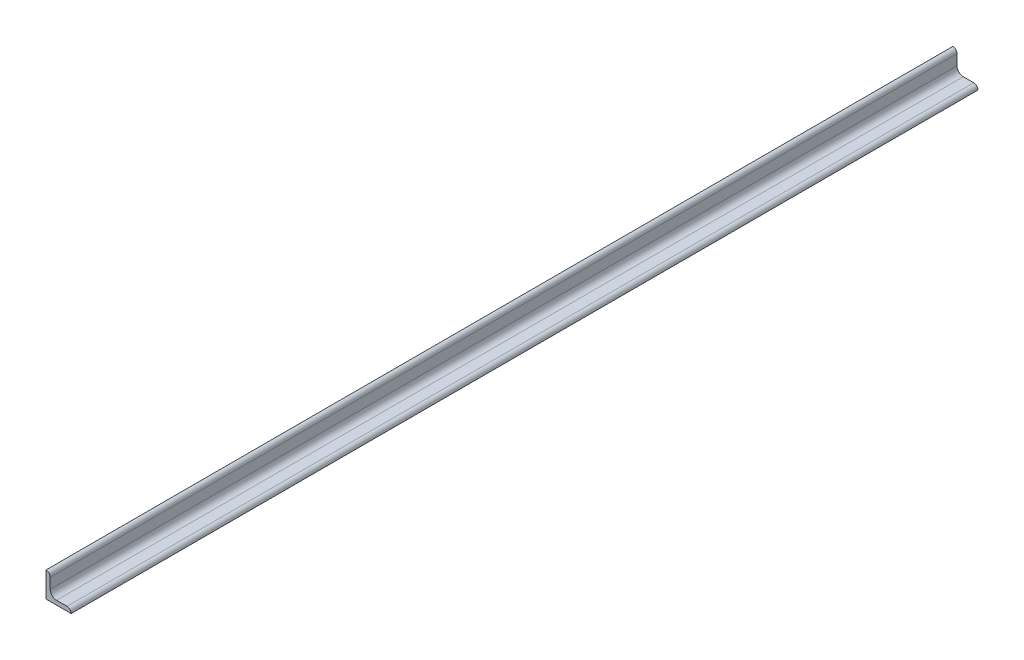
ISO-10303-21;
HEADER;
FILE_DESCRIPTION(('STEP AP214'),'2;1');
FILE_NAME('part.step','',(''),(''),'','','');
FILE_SCHEMA(('AUTOMOTIVE_DESIGN { 1 0 10303 214 1 1 1 1 }'));
ENDSEC;
DATA;
#1=APPLICATION_CONTEXT('core data for automotive mechanical design processes');
#2=APPLICATION_PROTOCOL_DEFINITION('international standard','automotive_design',2000,#1);
#3=PRODUCT_CONTEXT('',#1,'mechanical');
#4=PRODUCT('Part','Part','',(#3));
#5=PRODUCT_RELATED_PRODUCT_CATEGORY('part','',(#4));
#6=PRODUCT_DEFINITION_FORMATION('','',#4);
#7=PRODUCT_DEFINITION_CONTEXT('part definition',#1,'design');
#8=PRODUCT_DEFINITION('design','',#6,#7);
#9=PRODUCT_DEFINITION_SHAPE('','',#8);
#10=(LENGTH_UNIT() NAMED_UNIT(*) SI_UNIT(.MILLI.,.METRE.));
#11=(NAMED_UNIT(*) PLANE_ANGLE_UNIT() SI_UNIT($,.RADIAN.));
#12=(NAMED_UNIT(*) SI_UNIT($,.STERADIAN.) SOLID_ANGLE_UNIT());
#13=UNCERTAINTY_MEASURE_WITH_UNIT(LENGTH_MEASURE(1.E-05),#10,'distance_accuracy_value','');
#14=(GEOMETRIC_REPRESENTATION_CONTEXT(3) GLOBAL_UNCERTAINTY_ASSIGNED_CONTEXT((#13)) GLOBAL_UNIT_ASSIGNED_CONTEXT((#10,
#11,#12)) REPRESENTATION_CONTEXT('',''));
#15=CARTESIAN_POINT('',(0.,0.,0.));
#16=DIRECTION('',(0.,0.,1.));
#17=DIRECTION('',(1.,0.,0.));
#18=AXIS2_PLACEMENT_3D('',#15,#16,#17);
#19=CARTESIAN_POINT('',(19.05,0.,342.9));
#20=DIRECTION('',(0.,1.,0.));
#21=DIRECTION('',(-1.,0.,0.));
#22=AXIS2_PLACEMENT_3D('',#19,#20,#21);
#23=PLANE('',#22);
#24=DIRECTION('',(1.,0.,0.));
#25=VECTOR('',#24,1.);
#26=CARTESIAN_POINT('',(19.05,0.,-342.9));
#27=LINE('',#26,#25);
#28=CARTESIAN_POINT('',(0.,0.,-342.9));
#29=VERTEX_POINT('',#28);
#30=CARTESIAN_POINT('',(19.05,0.,-342.9));
#31=VERTEX_POINT('',#30);
#32=EDGE_CURVE('E134',#29,#31,#27,.T.);
#33=ORIENTED_EDGE('',*,*,#32,.T.);
#34=DIRECTION('',(0.,0.,-1.));
#35=VECTOR('',#34,1.);
#36=CARTESIAN_POINT('',(19.05,0.,342.9));
#37=LINE('',#36,#35);
#38=CARTESIAN_POINT('',(19.05,0.,342.9));
#39=VERTEX_POINT('',#38);
#40=EDGE_CURVE('E11',#39,#31,#37,.T.);
#41=ORIENTED_EDGE('',*,*,#40,.F.);
#42=DIRECTION('',(1.,0.,0.));
#43=VECTOR('',#42,1.);
#44=CARTESIAN_POINT('',(19.05,0.,342.9));
#45=LINE('',#44,#43);
#46=CARTESIAN_POINT('',(0.,0.,342.9));
#47=VERTEX_POINT('',#46);
#48=EDGE_CURVE('E150',#47,#39,#45,.T.);
#49=ORIENTED_EDGE('',*,*,#48,.F.);
#50=DIRECTION('',(0.,0.,-1.));
#51=VECTOR('',#50,1.);
#52=CARTESIAN_POINT('',(0.,0.,342.9));
#53=LINE('',#52,#51);
#54=EDGE_CURVE('E130',#47,#29,#53,.T.);
#55=ORIENTED_EDGE('',*,*,#54,.T.);
#56=EDGE_LOOP('',(#33,#41,#49,#55));
#57=FACE_BOUND('',#56,.T.);
#58=ADVANCED_FACE('F32',(#57),#23,.F.);
#59=CARTESIAN_POINT('',(19.05,0.00507999999999611,342.9));
#60=DIRECTION('',(-1.,0.,0.));
#61=DIRECTION('',(0.,0.,1.));
#62=AXIS2_PLACEMENT_3D('',#59,#60,#61);
#63=PLANE('',#62);
#64=DIRECTION('',(0.,1.,0.));
#65=VECTOR('',#64,1.);
#66=CARTESIAN_POINT('',(19.05,0.00507999999999611,-342.9));
#67=LINE('',#66,#65);
#68=CARTESIAN_POINT('',(19.05,0.00507999999999611,-342.9));
#69=VERTEX_POINT('',#68);
#70=EDGE_CURVE('E137',#31,#69,#67,.T.);
#71=ORIENTED_EDGE('',*,*,#70,.T.);
#72=DIRECTION('',(0.,0.,-1.));
#73=VECTOR('',#72,1.);
#74=CARTESIAN_POINT('',(19.05,0.00507999999999611,342.9));
#75=LINE('',#74,#73);
#76=CARTESIAN_POINT('',(19.05,0.00507999999999611,342.9));
#77=VERTEX_POINT('',#76);
#78=EDGE_CURVE('E40',#77,#69,#75,.T.);
#79=ORIENTED_EDGE('',*,*,#78,.F.);
#80=DIRECTION('',(0.,1.,0.));
#81=VECTOR('',#80,1.);
#82=CARTESIAN_POINT('',(19.05,0.00507999999999611,342.9));
#83=LINE('',#82,#81);
#84=EDGE_CURVE('E94',#39,#77,#83,.T.);
#85=ORIENTED_EDGE('',*,*,#84,.F.);
#86=ORIENTED_EDGE('',*,*,#40,.T.);
#87=EDGE_LOOP('',(#71,#79,#85,#86));
#88=FACE_BOUND('',#87,.T.);
#89=ADVANCED_FACE('F193',(#88),#63,.F.);
#90=CARTESIAN_POINT('',(15.88008,0.00507999999999573,342.9));
#91=DIRECTION('',(0.,0.,-1.));
#92=DIRECTION('',(-1.,0.,0.));
#93=AXIS2_PLACEMENT_3D('',#90,#91,#92);
#94=CYLINDRICAL_SURFACE('',#93,3.16992);
#95=CARTESIAN_POINT('',(15.88008,0.00507999999999573,-342.9));
#96=DIRECTION('',(0.,0.,1.));
#97=DIRECTION('',(1.,0.,0.));
#98=AXIS2_PLACEMENT_3D('',#95,#96,#97);
#99=CIRCLE('',#98,3.16992);
#100=CARTESIAN_POINT('',(15.88008,3.17499999999999,-342.9));
#101=VERTEX_POINT('',#100);
#102=EDGE_CURVE('E139',#69,#101,#99,.T.);
#103=ORIENTED_EDGE('',*,*,#102,.T.);
#104=DIRECTION('',(0.,0.,-1.));
#105=VECTOR('',#104,1.);
#106=CARTESIAN_POINT('',(15.88008,3.17499999999999,342.9));
#107=LINE('',#106,#105);
#108=CARTESIAN_POINT('',(15.88008,3.17499999999999,342.9));
#109=VERTEX_POINT('',#108);
#110=EDGE_CURVE('E160',#109,#101,#107,.T.);
#111=ORIENTED_EDGE('',*,*,#110,.F.);
#112=CARTESIAN_POINT('',(15.88008,0.00507999999999573,342.9));
#113=DIRECTION('',(0.,0.,1.));
#114=DIRECTION('',(1.,0.,0.));
#115=AXIS2_PLACEMENT_3D('',#112,#113,#114);
#116=CIRCLE('',#115,3.16992);
#117=EDGE_CURVE('E168',#77,#109,#116,.T.);
#118=ORIENTED_EDGE('',*,*,#117,.F.);
#119=ORIENTED_EDGE('',*,*,#78,.T.);
#120=EDGE_LOOP('',(#103,#111,#118,#119));
#121=FACE_BOUND('',#120,.T.);
#122=ADVANCED_FACE('F166',(#121),#94,.T.);
#123=CARTESIAN_POINT('',(7.93749999999999,3.175,342.9));
#124=DIRECTION('',(0.,-1.,0.));
#125=DIRECTION('',(1.,0.,0.));
#126=AXIS2_PLACEMENT_3D('',#123,#124,#125);
#127=PLANE('',#126);
#128=DIRECTION('',(-1.,0.,0.));
#129=VECTOR('',#128,1.);
#130=CARTESIAN_POINT('',(7.93749999999999,3.175,-342.9));
#131=LINE('',#130,#129);
#132=CARTESIAN_POINT('',(7.93749999999999,3.17499999999999,-342.9));
#133=VERTEX_POINT('',#132);
#134=EDGE_CURVE('E141',#101,#133,#131,.T.);
#135=ORIENTED_EDGE('',*,*,#134,.T.);
#136=DIRECTION('',(0.,0.,-1.));
#137=VECTOR('',#136,1.);
#138=CARTESIAN_POINT('',(7.93749999999999,3.17499999999999,342.9));
#139=LINE('',#138,#137);
#140=CARTESIAN_POINT('',(7.93749999999999,3.17499999999999,342.9));
#141=VERTEX_POINT('',#140);
#142=EDGE_CURVE('E157',#141,#133,#139,.T.);
#143=ORIENTED_EDGE('',*,*,#142,.F.);
#144=DIRECTION('',(-1.,0.,0.));
#145=VECTOR('',#144,1.);
#146=CARTESIAN_POINT('',(7.93749999999999,3.175,342.9));
#147=LINE('',#146,#145);
#148=EDGE_CURVE('E184',#109,#141,#147,.T.);
#149=ORIENTED_EDGE('',*,*,#148,.F.);
#150=ORIENTED_EDGE('',*,*,#110,.T.);
#151=EDGE_LOOP('',(#135,#143,#149,#150));
#152=FACE_BOUND('',#151,.T.);
#153=ADVANCED_FACE('F177',(#152),#127,.F.);
#154=CARTESIAN_POINT('',(7.93749999999999,7.93749999999999,342.9));
#155=DIRECTION('',(0.,0.,-1.));
#156=DIRECTION('',(-1.,0.,0.));
#157=AXIS2_PLACEMENT_3D('',#154,#155,#156);
#158=CYLINDRICAL_SURFACE('',#157,4.7625);
#159=CARTESIAN_POINT('',(7.93749999999999,7.93749999999999,-342.9));
#160=DIRECTION('',(0.,0.,-1.));
#161=DIRECTION('',(-1.,0.,0.));
#162=AXIS2_PLACEMENT_3D('',#159,#160,#161);
#163=CIRCLE('',#162,4.7625);
#164=CARTESIAN_POINT('',(3.17499999999999,7.93749999999999,-342.9));
#165=VERTEX_POINT('',#164);
#166=EDGE_CURVE('E143',#133,#165,#163,.T.);
#167=ORIENTED_EDGE('',*,*,#166,.T.);
#168=DIRECTION('',(0.,0.,-1.));
#169=VECTOR('',#168,1.);
#170=CARTESIAN_POINT('',(3.17499999999999,7.93749999999999,342.9));
#171=LINE('',#170,#169);
#172=CARTESIAN_POINT('',(3.17499999999999,7.93749999999999,342.9));
#173=VERTEX_POINT('',#172);
#174=EDGE_CURVE('E154',#173,#165,#171,.T.);
#175=ORIENTED_EDGE('',*,*,#174,.F.);
#176=CARTESIAN_POINT('',(7.93749999999999,7.93749999999999,342.9));
#177=DIRECTION('',(0.,0.,-1.));
#178=DIRECTION('',(-1.,0.,0.));
#179=AXIS2_PLACEMENT_3D('',#176,#177,#178);
#180=CIRCLE('',#179,4.7625);
#181=EDGE_CURVE('E183',#141,#173,#180,.T.);
#182=ORIENTED_EDGE('',*,*,#181,.F.);
#183=ORIENTED_EDGE('',*,*,#142,.T.);
#184=EDGE_LOOP('',(#167,#175,#182,#183));
#185=FACE_BOUND('',#184,.T.);
#186=ADVANCED_FACE('F181',(#185),#158,.F.);
#187=CARTESIAN_POINT('',(3.175,15.88008,342.9));
#188=DIRECTION('',(-1.,0.,0.));
#189=DIRECTION('',(0.,-1.,0.));
#190=AXIS2_PLACEMENT_3D('',#187,#188,#189);
#191=PLANE('',#190);
#192=DIRECTION('',(0.,1.,0.));
#193=VECTOR('',#192,1.);
#194=CARTESIAN_POINT('',(3.175,15.88008,-342.9));
#195=LINE('',#194,#193);
#196=CARTESIAN_POINT('',(3.17500000000001,15.88008,-342.9));
#197=VERTEX_POINT('',#196);
#198=EDGE_CURVE('E145',#165,#197,#195,.T.);
#199=ORIENTED_EDGE('',*,*,#198,.T.);
#200=DIRECTION('',(0.,0.,-1.));
#201=VECTOR('',#200,1.);
#202=CARTESIAN_POINT('',(3.17500000000001,15.88008,342.9));
#203=LINE('',#202,#201);
#204=CARTESIAN_POINT('',(3.17500000000001,15.88008,342.9));
#205=VERTEX_POINT('',#204);
#206=EDGE_CURVE('E125',#205,#197,#203,.T.);
#207=ORIENTED_EDGE('',*,*,#206,.F.);
#208=DIRECTION('',(0.,1.,0.));
#209=VECTOR('',#208,1.);
#210=CARTESIAN_POINT('',(3.175,15.88008,342.9));
#211=LINE('',#210,#209);
#212=EDGE_CURVE('E116',#173,#205,#211,.T.);
#213=ORIENTED_EDGE('',*,*,#212,.F.);
#214=ORIENTED_EDGE('',*,*,#174,.T.);
#215=EDGE_LOOP('',(#199,#207,#213,#214));
#216=FACE_BOUND('',#215,.T.);
#217=ADVANCED_FACE('F205',(#216),#191,.F.);
#218=CARTESIAN_POINT('',(0.00508000000000019,15.88008,342.9));
#219=DIRECTION('',(0.,0.,-1.));
#220=DIRECTION('',(-1.,0.,0.));
#221=AXIS2_PLACEMENT_3D('',#218,#219,#220);
#222=CYLINDRICAL_SURFACE('',#221,3.16992);
#223=CARTESIAN_POINT('',(0.00508000000000019,15.88008,-342.9));
#224=DIRECTION('',(0.,0.,1.));
#225=DIRECTION('',(-1.,0.,0.));
#226=AXIS2_PLACEMENT_3D('',#223,#224,#225);
#227=CIRCLE('',#226,3.16992);
#228=CARTESIAN_POINT('',(0.00508,19.05,-342.9));
#229=VERTEX_POINT('',#228);
#230=EDGE_CURVE('E124',#197,#229,#227,.T.);
#231=ORIENTED_EDGE('',*,*,#230,.T.);
#232=DIRECTION('',(0.,0.,-1.));
#233=VECTOR('',#232,1.);
#234=CARTESIAN_POINT('',(0.00508,19.05,342.9));
#235=LINE('',#234,#233);
#236=CARTESIAN_POINT('',(0.00508,19.05,342.9));
#237=VERTEX_POINT('',#236);
#238=EDGE_CURVE('E121',#237,#229,#235,.T.);
#239=ORIENTED_EDGE('',*,*,#238,.F.);
#240=CARTESIAN_POINT('',(0.00508000000000019,15.88008,342.9));
#241=DIRECTION('',(0.,0.,1.));
#242=DIRECTION('',(-1.,0.,0.));
#243=AXIS2_PLACEMENT_3D('',#240,#241,#242);
#244=CIRCLE('',#243,3.16992);
#245=EDGE_CURVE('E110',#205,#237,#244,.T.);
#246=ORIENTED_EDGE('',*,*,#245,.F.);
#247=ORIENTED_EDGE('',*,*,#206,.T.);
#248=EDGE_LOOP('',(#231,#239,#246,#247));
#249=FACE_BOUND('',#248,.T.);
#250=ADVANCED_FACE('F122',(#249),#222,.T.);
#251=CARTESIAN_POINT('',(0.,19.05,342.9));
#252=DIRECTION('',(0.,-1.,0.));
#253=DIRECTION('',(0.,0.,-1.));
#254=AXIS2_PLACEMENT_3D('',#251,#252,#253);
#255=PLANE('',#254);
#256=DIRECTION('',(-1.,0.,0.));
#257=VECTOR('',#256,1.);
#258=CARTESIAN_POINT('',(0.,19.05,-342.9));
#259=LINE('',#258,#257);
#260=CARTESIAN_POINT('',(0.,19.05,-342.9));
#261=VERTEX_POINT('',#260);
#262=EDGE_CURVE('E80',#229,#261,#259,.T.);
#263=ORIENTED_EDGE('',*,*,#262,.T.);
#264=DIRECTION('',(0.,0.,-1.));
#265=VECTOR('',#264,1.);
#266=CARTESIAN_POINT('',(0.,19.05,342.9));
#267=LINE('',#266,#265);
#268=CARTESIAN_POINT('',(0.,19.05,342.9));
#269=VERTEX_POINT('',#268);
#270=EDGE_CURVE('E126',#269,#261,#267,.T.);
#271=ORIENTED_EDGE('',*,*,#270,.F.);
#272=DIRECTION('',(-1.,0.,0.));
#273=VECTOR('',#272,1.);
#274=CARTESIAN_POINT('',(0.,19.05,342.9));
#275=LINE('',#274,#273);
#276=EDGE_CURVE('E114',#237,#269,#275,.T.);
#277=ORIENTED_EDGE('',*,*,#276,.F.);
#278=ORIENTED_EDGE('',*,*,#238,.T.);
#279=EDGE_LOOP('',(#263,#271,#277,#278));
#280=FACE_BOUND('',#279,.T.);
#281=ADVANCED_FACE('F128',(#280),#255,.F.);
#282=CARTESIAN_POINT('',(0.,0.,342.9));
#283=DIRECTION('',(1.,0.,0.));
#284=DIRECTION('',(0.,1.,0.));
#285=AXIS2_PLACEMENT_3D('',#282,#283,#284);
#286=PLANE('',#285);
#287=DIRECTION('',(0.,-1.,0.));
#288=VECTOR('',#287,1.);
#289=CARTESIAN_POINT('',(0.,0.,-342.9));
#290=LINE('',#289,#288);
#291=EDGE_CURVE('E86',#261,#29,#290,.T.);
#292=ORIENTED_EDGE('',*,*,#291,.T.);
#293=ORIENTED_EDGE('',*,*,#54,.F.);
#294=DIRECTION('',(0.,-1.,0.));
#295=VECTOR('',#294,1.);
#296=CARTESIAN_POINT('',(0.,0.,342.9));
#297=LINE('',#296,#295);
#298=EDGE_CURVE('E48',#269,#47,#297,.T.);
#299=ORIENTED_EDGE('',*,*,#298,.F.);
#300=ORIENTED_EDGE('',*,*,#270,.T.);
#301=EDGE_LOOP('',(#292,#293,#299,#300));
#302=FACE_BOUND('',#301,.T.);
#303=ADVANCED_FACE('F213',(#302),#286,.F.);
#304=CARTESIAN_POINT('',(0.00508000000000019,15.88008,342.9));
#305=DIRECTION('',(0.,0.,-1.));
#306=DIRECTION('',(-1.,0.,0.));
#307=AXIS2_PLACEMENT_3D('',#304,#305,#306);
#308=PLANE('',#307);
#309=ORIENTED_EDGE('',*,*,#48,.T.);
#310=ORIENTED_EDGE('',*,*,#84,.T.);
#311=ORIENTED_EDGE('',*,*,#117,.T.);
#312=ORIENTED_EDGE('',*,*,#148,.T.);
#313=ORIENTED_EDGE('',*,*,#181,.T.);
#314=ORIENTED_EDGE('',*,*,#212,.T.);
#315=ORIENTED_EDGE('',*,*,#245,.T.);
#316=ORIENTED_EDGE('',*,*,#276,.T.);
#317=ORIENTED_EDGE('',*,*,#298,.T.);
#318=EDGE_LOOP('',(#309,#310,#311,#312,#313,#314,#315,#316,#317));
#319=FACE_BOUND('',#318,.T.);
#320=ADVANCED_FACE('F112',(#319),#308,.F.);
#321=CARTESIAN_POINT('',(0.00508000000000019,15.88008,-342.9));
#322=DIRECTION('',(0.,0.,-1.));
#323=DIRECTION('',(-1.,0.,0.));
#324=AXIS2_PLACEMENT_3D('',#321,#322,#323);
#325=PLANE('',#324);
#326=ORIENTED_EDGE('',*,*,#32,.F.);
#327=ORIENTED_EDGE('',*,*,#291,.F.);
#328=ORIENTED_EDGE('',*,*,#262,.F.);
#329=ORIENTED_EDGE('',*,*,#230,.F.);
#330=ORIENTED_EDGE('',*,*,#198,.F.);
#331=ORIENTED_EDGE('',*,*,#166,.F.);
#332=ORIENTED_EDGE('',*,*,#134,.F.);
#333=ORIENTED_EDGE('',*,*,#102,.F.);
#334=ORIENTED_EDGE('',*,*,#70,.F.);
#335=EDGE_LOOP('',(#326,#327,#328,#329,#330,#331,#332,#333,#334));
#336=FACE_BOUND('',#335,.T.);
#337=ADVANCED_FACE('F172',(#336),#325,.T.);
#338=CLOSED_SHELL('',(#58,#89,#122,#153,#186,#217,#250,#281,#303,#320,#337));
#339=MANIFOLD_SOLID_BREP('B2',#338);
#340=ADVANCED_BREP_SHAPE_REPRESENTATION('',(#18,#339),#14);
#341=SHAPE_DEFINITION_REPRESENTATION(#9,#340);
ENDSEC;
END-ISO-10303-21;
